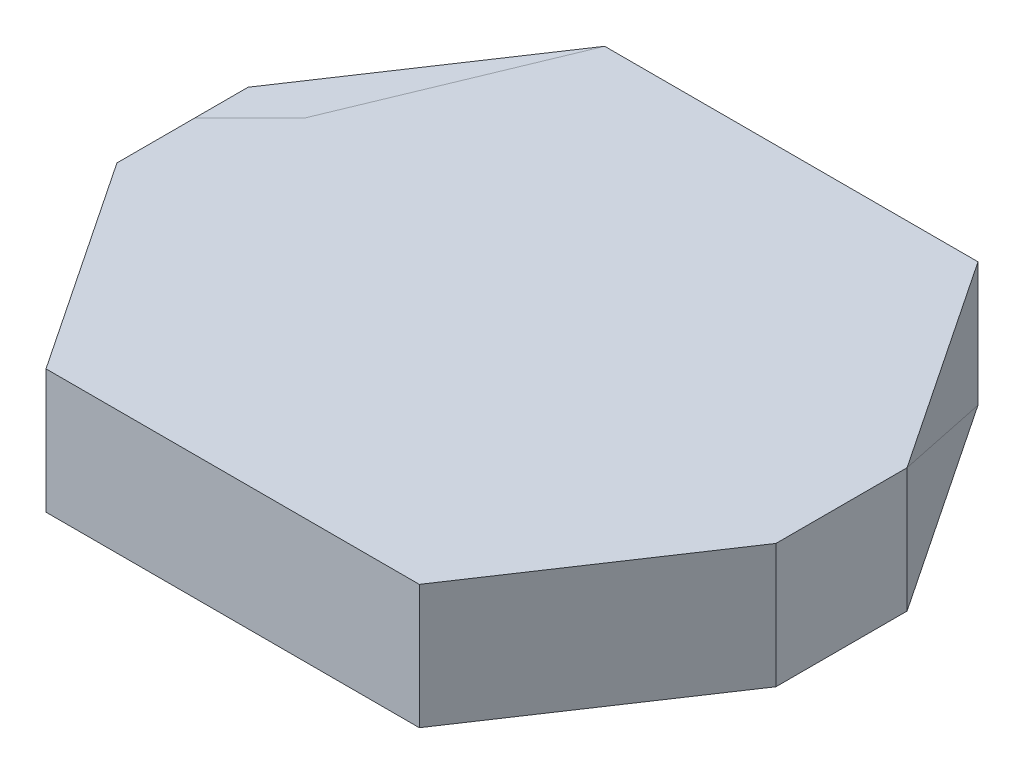
ISO-10303-21;
HEADER;
FILE_DESCRIPTION(('STEP AP214'),'2;1');
FILE_NAME('part.step','',(''),(''),'','','');
FILE_SCHEMA(('AUTOMOTIVE_DESIGN { 1 0 10303 214 1 1 1 1 }'));
ENDSEC;
DATA;
#1=APPLICATION_CONTEXT('core data for automotive mechanical design processes');
#2=APPLICATION_PROTOCOL_DEFINITION('international standard','automotive_design',2000,#1);
#3=PRODUCT_CONTEXT('',#1,'mechanical');
#4=PRODUCT('Part','Part','',(#3));
#5=PRODUCT_RELATED_PRODUCT_CATEGORY('part','',(#4));
#6=PRODUCT_DEFINITION_FORMATION('','',#4);
#7=PRODUCT_DEFINITION_CONTEXT('part definition',#1,'design');
#8=PRODUCT_DEFINITION('design','',#6,#7);
#9=PRODUCT_DEFINITION_SHAPE('','',#8);
#10=(LENGTH_UNIT() NAMED_UNIT(*) SI_UNIT(.MILLI.,.METRE.));
#11=(NAMED_UNIT(*) PLANE_ANGLE_UNIT() SI_UNIT($,.RADIAN.));
#12=(NAMED_UNIT(*) SI_UNIT($,.STERADIAN.) SOLID_ANGLE_UNIT());
#13=UNCERTAINTY_MEASURE_WITH_UNIT(LENGTH_MEASURE(1.E-05),#10,'distance_accuracy_value','');
#14=(GEOMETRIC_REPRESENTATION_CONTEXT(3) GLOBAL_UNCERTAINTY_ASSIGNED_CONTEXT((#13)) GLOBAL_UNIT_ASSIGNED_CONTEXT((#10,
#11,#12)) REPRESENTATION_CONTEXT('',''));
#15=CARTESIAN_POINT('',(0.,0.,0.));
#16=DIRECTION('',(0.,0.,1.));
#17=DIRECTION('',(1.,0.,0.));
#18=AXIS2_PLACEMENT_3D('',#15,#16,#17);
#19=CARTESIAN_POINT('',(26.5398584417511,10.,5.27910607256974));
#20=DIRECTION('',(-1.,0.,0.));
#21=DIRECTION('',(0.,0.,1.));
#22=AXIS2_PLACEMENT_3D('',#19,#20,#21);
#23=PLANE('',#22);
#24=DIRECTION('',(0.,0.,-1.));
#25=VECTOR('',#24,1.);
#26=CARTESIAN_POINT('',(26.5398584417511,0.,5.27910607256974));
#27=LINE('',#26,#25);
#28=CARTESIAN_POINT('',(26.5398584417511,0.,5.27910607256974));
#29=VERTEX_POINT('',#28);
#30=CARTESIAN_POINT('',(26.5398584417511,0.,-5.27910607256975));
#31=VERTEX_POINT('',#30);
#32=EDGE_CURVE('E147',#29,#31,#27,.T.);
#33=ORIENTED_EDGE('',*,*,#32,.T.);
#34=DIRECTION('',(0.,-1.,0.));
#35=VECTOR('',#34,1.);
#36=CARTESIAN_POINT('',(26.5398584417511,10.,-5.27910607256975));
#37=LINE('',#36,#35);
#38=CARTESIAN_POINT('',(26.5398584417511,10.,-5.27910607256975));
#39=VERTEX_POINT('',#38);
#40=EDGE_CURVE('E12',#39,#31,#37,.T.);
#41=ORIENTED_EDGE('',*,*,#40,.F.);
#42=DIRECTION('',(0.,0.,-1.));
#43=VECTOR('',#42,1.);
#44=CARTESIAN_POINT('',(26.5398584417511,10.,5.27910607256974));
#45=LINE('',#44,#43);
#46=CARTESIAN_POINT('',(26.5398584417511,10.,5.27910607256974));
#47=VERTEX_POINT('',#46);
#48=EDGE_CURVE('E161',#47,#39,#45,.T.);
#49=ORIENTED_EDGE('',*,*,#48,.F.);
#50=DIRECTION('',(0.,-1.,0.));
#51=VECTOR('',#50,1.);
#52=CARTESIAN_POINT('',(26.5398584417511,10.,5.27910607256974));
#53=LINE('',#52,#51);
#54=EDGE_CURVE('E143',#47,#29,#53,.T.);
#55=ORIENTED_EDGE('',*,*,#54,.T.);
#56=EDGE_LOOP('',(#33,#41,#49,#55));
#57=FACE_BOUND('',#56,.T.);
#58=ADVANCED_FACE('F51',(#57),#23,.F.);
#59=CARTESIAN_POINT('',(26.5398584417511,10.,-5.27910607256975));
#60=DIRECTION('',(-0.831469612302545,0.,0.555570233019603));
#61=DIRECTION('',(0.555570233019603,0.,0.831469612302545));
#62=AXIS2_PLACEMENT_3D('',#59,#60,#61);
#63=PLANE('',#62);
#64=DIRECTION('',(-0.555570233019603,0.,-0.831469612302545));
#65=VECTOR('',#64,1.);
#66=CARTESIAN_POINT('',(26.5398584417511,0.,-5.27910607256975));
#67=LINE('',#66,#65);
#68=CARTESIAN_POINT('',(15.0336221733761,0.,-22.4994055784104));
#69=VERTEX_POINT('',#68);
#70=EDGE_CURVE('E150',#31,#69,#67,.T.);
#71=ORIENTED_EDGE('',*,*,#70,.T.);
#72=DIRECTION('',(0.,-1.,0.));
#73=VECTOR('',#72,1.);
#74=CARTESIAN_POINT('',(15.0336221733761,10.,-22.4994055784104));
#75=LINE('',#74,#73);
#76=CARTESIAN_POINT('',(15.0336221733761,10.,-22.4994055784104));
#77=VERTEX_POINT('',#76);
#78=EDGE_CURVE('E59',#77,#69,#75,.T.);
#79=ORIENTED_EDGE('',*,*,#78,.F.);
#80=DIRECTION('',(-0.555570233019603,0.,-0.831469612302545));
#81=VECTOR('',#80,1.);
#82=CARTESIAN_POINT('',(26.5398584417511,10.,-5.27910607256975));
#83=LINE('',#82,#81);
#84=EDGE_CURVE('E110',#39,#77,#83,.T.);
#85=ORIENTED_EDGE('',*,*,#84,.F.);
#86=ORIENTED_EDGE('',*,*,#40,.T.);
#87=EDGE_LOOP('',(#71,#79,#85,#86));
#88=FACE_BOUND('',#87,.T.);
#89=ADVANCED_FACE('F196',(#88),#63,.F.);
#90=CARTESIAN_POINT('',(15.0336221733761,10.,-22.4994055784104));
#91=DIRECTION('',(0.,0.,1.));
#92=DIRECTION('',(1.,0.,0.));
#93=AXIS2_PLACEMENT_3D('',#90,#91,#92);
#94=PLANE('',#93);
#95=DIRECTION('',(-1.,0.,0.));
#96=VECTOR('',#95,1.);
#97=CARTESIAN_POINT('',(15.0336221733761,0.,-22.4994055784104));
#98=LINE('',#97,#96);
#99=CARTESIAN_POINT('',(-15.0336221733761,0.,-22.4994055784104));
#100=VERTEX_POINT('',#99);
#101=EDGE_CURVE('E152',#69,#100,#98,.T.);
#102=ORIENTED_EDGE('',*,*,#101,.T.);
#103=DIRECTION('',(0.,-1.,0.));
#104=VECTOR('',#103,1.);
#105=CARTESIAN_POINT('',(-15.0336221733761,10.,-22.4994055784104));
#106=LINE('',#105,#104);
#107=CARTESIAN_POINT('',(-15.0336221733761,10.,-22.4994055784104));
#108=VERTEX_POINT('',#107);
#109=EDGE_CURVE('E168',#108,#100,#106,.T.);
#110=ORIENTED_EDGE('',*,*,#109,.F.);
#111=DIRECTION('',(-1.,0.,0.));
#112=VECTOR('',#111,1.);
#113=CARTESIAN_POINT('',(15.0336221733761,10.,-22.4994055784104));
#114=LINE('',#113,#112);
#115=EDGE_CURVE('E176',#77,#108,#114,.T.);
#116=ORIENTED_EDGE('',*,*,#115,.F.);
#117=ORIENTED_EDGE('',*,*,#78,.T.);
#118=EDGE_LOOP('',(#102,#110,#116,#117));
#119=FACE_BOUND('',#118,.T.);
#120=ADVANCED_FACE('F174',(#119),#94,.F.);
#121=CARTESIAN_POINT('',(-15.0336221733761,10.,-22.4994055784104));
#122=DIRECTION('',(0.831469612302545,0.,0.555570233019603));
#123=DIRECTION('',(0.555570233019603,0.,-0.831469612302545));
#124=AXIS2_PLACEMENT_3D('',#121,#122,#123);
#125=PLANE('',#124);
#126=DIRECTION('',(-0.555570233019603,0.,0.831469612302545));
#127=VECTOR('',#126,1.);
#128=CARTESIAN_POINT('',(-15.0336221733761,0.,-22.4994055784104));
#129=LINE('',#128,#127);
#130=CARTESIAN_POINT('',(-26.5398584417511,0.,-5.27910607256975));
#131=VERTEX_POINT('',#130);
#132=EDGE_CURVE('E154',#100,#131,#129,.T.);
#133=ORIENTED_EDGE('',*,*,#132,.T.);
#134=DIRECTION('',(0.,-1.,0.));
#135=VECTOR('',#134,1.);
#136=CARTESIAN_POINT('',(-26.5398584417511,10.,-5.27910607256975));
#137=LINE('',#136,#135);
#138=CARTESIAN_POINT('',(-26.5398584417511,10.,-5.27910607256975));
#139=VERTEX_POINT('',#138);
#140=EDGE_CURVE('E165',#139,#131,#137,.T.);
#141=ORIENTED_EDGE('',*,*,#140,.F.);
#142=DIRECTION('',(-0.555570233019603,0.,0.831469612302545));
#143=VECTOR('',#142,1.);
#144=CARTESIAN_POINT('',(-15.0336221733761,10.,-22.4994055784104));
#145=LINE('',#144,#143);
#146=EDGE_CURVE('E188',#108,#139,#145,.T.);
#147=ORIENTED_EDGE('',*,*,#146,.F.);
#148=ORIENTED_EDGE('',*,*,#109,.T.);
#149=EDGE_LOOP('',(#133,#141,#147,#148));
#150=FACE_BOUND('',#149,.T.);
#151=ADVANCED_FACE('F184',(#150),#125,.F.);
#152=CARTESIAN_POINT('',(-26.5398584417511,10.,-5.27910607256975));
#153=DIRECTION('',(1.,0.,0.));
#154=DIRECTION('',(0.,0.,-1.));
#155=AXIS2_PLACEMENT_3D('',#152,#153,#154);
#156=PLANE('',#155);
#157=DIRECTION('',(0.,0.,1.));
#158=VECTOR('',#157,1.);
#159=CARTESIAN_POINT('',(-26.5398584417511,0.,-5.27910607256975));
#160=LINE('',#159,#158);
#161=CARTESIAN_POINT('',(-26.5398584417511,0.,5.27910607256974));
#162=VERTEX_POINT('',#161);
#163=EDGE_CURVE('E156',#131,#162,#160,.T.);
#164=ORIENTED_EDGE('',*,*,#163,.T.);
#165=DIRECTION('',(0.,-1.,0.));
#166=VECTOR('',#165,1.);
#167=CARTESIAN_POINT('',(-26.5398584417511,10.,5.27910607256974));
#168=LINE('',#167,#166);
#169=CARTESIAN_POINT('',(-26.5398584417511,10.,5.27910607256974));
#170=VERTEX_POINT('',#169);
#171=EDGE_CURVE('E138',#170,#162,#168,.T.);
#172=ORIENTED_EDGE('',*,*,#171,.F.);
#173=DIRECTION('',(0.,0.,1.));
#174=VECTOR('',#173,1.);
#175=CARTESIAN_POINT('',(-26.5398584417511,10.,-5.27910607256975));
#176=LINE('',#175,#174);
#177=EDGE_CURVE('E129',#139,#170,#176,.T.);
#178=ORIENTED_EDGE('',*,*,#177,.F.);
#179=ORIENTED_EDGE('',*,*,#140,.T.);
#180=EDGE_LOOP('',(#164,#172,#178,#179));
#181=FACE_BOUND('',#180,.T.);
#182=ADVANCED_FACE('F187',(#181),#156,.F.);
#183=CARTESIAN_POINT('',(-26.5398584417511,10.,5.27910607256974));
#184=DIRECTION('',(0.831469612302545,0.,-0.555570233019603));
#185=DIRECTION('',(-0.555570233019603,0.,-0.831469612302545));
#186=AXIS2_PLACEMENT_3D('',#183,#184,#185);
#187=PLANE('',#186);
#188=DIRECTION('',(0.555570233019603,0.,0.831469612302545));
#189=VECTOR('',#188,1.);
#190=CARTESIAN_POINT('',(-26.5398584417511,0.,5.27910607256974));
#191=LINE('',#190,#189);
#192=CARTESIAN_POINT('',(-15.0336221733761,0.,22.4994055784104));
#193=VERTEX_POINT('',#192);
#194=EDGE_CURVE('E137',#162,#193,#191,.T.);
#195=ORIENTED_EDGE('',*,*,#194,.T.);
#196=DIRECTION('',(0.,-1.,0.));
#197=VECTOR('',#196,1.);
#198=CARTESIAN_POINT('',(-15.0336221733761,10.,22.4994055784104));
#199=LINE('',#198,#197);
#200=CARTESIAN_POINT('',(-15.0336221733761,10.,22.4994055784104));
#201=VERTEX_POINT('',#200);
#202=EDGE_CURVE('E134',#201,#193,#199,.T.);
#203=ORIENTED_EDGE('',*,*,#202,.F.);
#204=DIRECTION('',(0.555570233019603,0.,0.831469612302545));
#205=VECTOR('',#204,1.);
#206=CARTESIAN_POINT('',(-26.5398584417511,10.,5.27910607256974));
#207=LINE('',#206,#205);
#208=EDGE_CURVE('E123',#170,#201,#207,.T.);
#209=ORIENTED_EDGE('',*,*,#208,.F.);
#210=ORIENTED_EDGE('',*,*,#171,.T.);
#211=EDGE_LOOP('',(#195,#203,#209,#210));
#212=FACE_BOUND('',#211,.T.);
#213=ADVANCED_FACE('F135',(#212),#187,.F.);
#214=CARTESIAN_POINT('',(-15.0336221733761,10.,22.4994055784104));
#215=DIRECTION('',(0.,0.,-1.));
#216=DIRECTION('',(-1.,0.,0.));
#217=AXIS2_PLACEMENT_3D('',#214,#215,#216);
#218=PLANE('',#217);
#219=DIRECTION('',(1.,0.,0.));
#220=VECTOR('',#219,1.);
#221=CARTESIAN_POINT('',(-15.0336221733761,0.,22.4994055784104));
#222=LINE('',#221,#220);
#223=CARTESIAN_POINT('',(15.0336221733761,0.,22.4994055784104));
#224=VERTEX_POINT('',#223);
#225=EDGE_CURVE('E96',#193,#224,#222,.T.);
#226=ORIENTED_EDGE('',*,*,#225,.T.);
#227=DIRECTION('',(0.,-1.,0.));
#228=VECTOR('',#227,1.);
#229=CARTESIAN_POINT('',(15.0336221733761,10.,22.4994055784104));
#230=LINE('',#229,#228);
#231=CARTESIAN_POINT('',(15.0336221733761,10.,22.4994055784104));
#232=VERTEX_POINT('',#231);
#233=EDGE_CURVE('E139',#232,#224,#230,.T.);
#234=ORIENTED_EDGE('',*,*,#233,.F.);
#235=DIRECTION('',(1.,0.,0.));
#236=VECTOR('',#235,1.);
#237=CARTESIAN_POINT('',(-15.0336221733761,10.,22.4994055784104));
#238=LINE('',#237,#236);
#239=EDGE_CURVE('E127',#201,#232,#238,.T.);
#240=ORIENTED_EDGE('',*,*,#239,.F.);
#241=ORIENTED_EDGE('',*,*,#202,.T.);
#242=EDGE_LOOP('',(#226,#234,#240,#241));
#243=FACE_BOUND('',#242,.T.);
#244=ADVANCED_FACE('F141',(#243),#218,.F.);
#245=CARTESIAN_POINT('',(15.0336221733761,10.,22.4994055784104));
#246=DIRECTION('',(-0.831469612302545,0.,-0.555570233019603));
#247=DIRECTION('',(-0.555570233019603,0.,0.831469612302545));
#248=AXIS2_PLACEMENT_3D('',#245,#246,#247);
#249=PLANE('',#248);
#250=DIRECTION('',(0.555570233019603,0.,-0.831469612302545));
#251=VECTOR('',#250,1.);
#252=CARTESIAN_POINT('',(15.0336221733761,0.,22.4994055784104));
#253=LINE('',#252,#251);
#254=EDGE_CURVE('E102',#224,#29,#253,.T.);
#255=ORIENTED_EDGE('',*,*,#254,.T.);
#256=ORIENTED_EDGE('',*,*,#54,.F.);
#257=DIRECTION('',(0.555570233019603,0.,-0.831469612302545));
#258=VECTOR('',#257,1.);
#259=CARTESIAN_POINT('',(15.0336221733761,10.,22.4994055784104));
#260=LINE('',#259,#258);
#261=EDGE_CURVE('E67',#232,#47,#260,.T.);
#262=ORIENTED_EDGE('',*,*,#261,.F.);
#263=ORIENTED_EDGE('',*,*,#233,.T.);
#264=EDGE_LOOP('',(#255,#256,#262,#263));
#265=FACE_BOUND('',#264,.T.);
#266=ADVANCED_FACE('F212',(#265),#249,.F.);
#267=CARTESIAN_POINT('',(0.,10.,0.));
#268=DIRECTION('',(0.,1.,0.));
#269=DIRECTION('',(0.,0.,1.));
#270=AXIS2_PLACEMENT_3D('',#267,#268,#269);
#271=PLANE('',#270);
#272=ORIENTED_EDGE('',*,*,#48,.T.);
#273=ORIENTED_EDGE('',*,*,#84,.T.);
#274=ORIENTED_EDGE('',*,*,#115,.T.);
#275=ORIENTED_EDGE('',*,*,#146,.T.);
#276=ORIENTED_EDGE('',*,*,#177,.T.);
#277=ORIENTED_EDGE('',*,*,#208,.T.);
#278=ORIENTED_EDGE('',*,*,#239,.T.);
#279=ORIENTED_EDGE('',*,*,#261,.T.);
#280=EDGE_LOOP('',(#272,#273,#274,#275,#276,#277,#278,#279));
#281=FACE_BOUND('',#280,.T.);
#282=ADVANCED_FACE('F125',(#281),#271,.T.);
#283=CARTESIAN_POINT('',(0.,0.,0.));
#284=DIRECTION('',(0.,1.,0.));
#285=DIRECTION('',(0.,0.,1.));
#286=AXIS2_PLACEMENT_3D('',#283,#284,#285);
#287=PLANE('',#286);
#288=ORIENTED_EDGE('',*,*,#32,.F.);
#289=ORIENTED_EDGE('',*,*,#254,.F.);
#290=ORIENTED_EDGE('',*,*,#225,.F.);
#291=ORIENTED_EDGE('',*,*,#194,.F.);
#292=ORIENTED_EDGE('',*,*,#163,.F.);
#293=ORIENTED_EDGE('',*,*,#132,.F.);
#294=ORIENTED_EDGE('',*,*,#101,.F.);
#295=ORIENTED_EDGE('',*,*,#70,.F.);
#296=EDGE_LOOP('',(#288,#289,#290,#291,#292,#293,#294,#295));
#297=FACE_BOUND('',#296,.T.);
#298=ADVANCED_FACE('F180',(#297),#287,.F.);
#299=CLOSED_SHELL('',(#58,#89,#120,#151,#182,#213,#244,#266,#282,#298));
#300=MANIFOLD_SOLID_BREP('B2',#299);
#301=CARTESIAN_POINT('',(26.5398584417511,10.,5.27910607256974));
#302=DIRECTION('',(-1.,0.,0.));
#303=DIRECTION('',(0.,0.,1.));
#304=AXIS2_PLACEMENT_3D('',#301,#302,#303);
#305=PLANE('',#304);
#306=DIRECTION('',(0.,0.,-1.));
#307=VECTOR('',#306,1.);
#308=CARTESIAN_POINT('',(26.5398584417511,0.,5.27910607256974));
#309=LINE('',#308,#307);
#310=CARTESIAN_POINT('',(26.5398584417511,0.,5.27910607256974));
#311=VERTEX_POINT('',#310);
#312=CARTESIAN_POINT('',(26.5398584417511,0.,-5.27910607256975));
#313=VERTEX_POINT('',#312);
#314=EDGE_CURVE('E375',#311,#313,#309,.T.);
#315=ORIENTED_EDGE('',*,*,#314,.T.);
#316=DIRECTION('',(0.,-1.,0.));
#317=VECTOR('',#316,1.);
#318=CARTESIAN_POINT('',(26.5398584417511,10.,-5.27910607256975));
#319=LINE('',#318,#317);
#320=CARTESIAN_POINT('',(26.5398584417511,10.,-5.27910607256975));
#321=VERTEX_POINT('',#320);
#322=EDGE_CURVE('E49',#321,#313,#319,.T.);
#323=ORIENTED_EDGE('',*,*,#322,.F.);
#324=DIRECTION('',(0.,0.,-1.));
#325=VECTOR('',#324,1.);
#326=CARTESIAN_POINT('',(26.5398584417511,10.,5.27910607256974));
#327=LINE('',#326,#325);
#328=CARTESIAN_POINT('',(26.5398584417511,10.,5.27910607256974));
#329=VERTEX_POINT('',#328);
#330=EDGE_CURVE('E389',#329,#321,#327,.T.);
#331=ORIENTED_EDGE('',*,*,#330,.F.);
#332=DIRECTION('',(0.,-1.,0.));
#333=VECTOR('',#332,1.);
#334=CARTESIAN_POINT('',(26.5398584417511,10.,5.27910607256974));
#335=LINE('',#334,#333);
#336=EDGE_CURVE('E371',#329,#311,#335,.T.);
#337=ORIENTED_EDGE('',*,*,#336,.T.);
#338=EDGE_LOOP('',(#315,#323,#331,#337));
#339=FACE_BOUND('',#338,.T.);
#340=ADVANCED_FACE('F279',(#339),#305,.F.);
#341=CARTESIAN_POINT('',(26.5398584417511,10.,-5.27910607256975));
#342=DIRECTION('',(-0.831469612302545,0.,0.555570233019603));
#343=DIRECTION('',(0.555570233019603,0.,0.831469612302545));
#344=AXIS2_PLACEMENT_3D('',#341,#342,#343);
#345=PLANE('',#344);
#346=DIRECTION('',(-0.555570233019603,0.,-0.831469612302545));
#347=VECTOR('',#346,1.);
#348=CARTESIAN_POINT('',(26.5398584417511,0.,-5.27910607256975));
#349=LINE('',#348,#347);
#350=CARTESIAN_POINT('',(15.0336221733761,0.,-22.4994055784104));
#351=VERTEX_POINT('',#350);
#352=EDGE_CURVE('E378',#313,#351,#349,.T.);
#353=ORIENTED_EDGE('',*,*,#352,.T.);
#354=DIRECTION('',(0.,-1.,0.));
#355=VECTOR('',#354,1.);
#356=CARTESIAN_POINT('',(15.0336221733761,10.,-22.4994055784104));
#357=LINE('',#356,#355);
#358=CARTESIAN_POINT('',(15.0336221733761,10.,-22.4994055784104));
#359=VERTEX_POINT('',#358);
#360=EDGE_CURVE('E287',#359,#351,#357,.T.);
#361=ORIENTED_EDGE('',*,*,#360,.F.);
#362=DIRECTION('',(-0.555570233019603,0.,-0.831469612302545));
#363=VECTOR('',#362,1.);
#364=CARTESIAN_POINT('',(26.5398584417511,10.,-5.27910607256975));
#365=LINE('',#364,#363);
#366=EDGE_CURVE('E338',#321,#359,#365,.T.);
#367=ORIENTED_EDGE('',*,*,#366,.F.);
#368=ORIENTED_EDGE('',*,*,#322,.T.);
#369=EDGE_LOOP('',(#353,#361,#367,#368));
#370=FACE_BOUND('',#369,.T.);
#371=ADVANCED_FACE('F424',(#370),#345,.F.);
#372=CARTESIAN_POINT('',(15.0336221733761,10.,-22.4994055784104));
#373=DIRECTION('',(0.,0.,1.));
#374=DIRECTION('',(1.,0.,0.));
#375=AXIS2_PLACEMENT_3D('',#372,#373,#374);
#376=PLANE('',#375);
#377=DIRECTION('',(-1.,0.,0.));
#378=VECTOR('',#377,1.);
#379=CARTESIAN_POINT('',(15.0336221733761,0.,-22.4994055784104));
#380=LINE('',#379,#378);
#381=CARTESIAN_POINT('',(-15.0336221733761,0.,-22.4994055784104));
#382=VERTEX_POINT('',#381);
#383=EDGE_CURVE('E380',#351,#382,#380,.T.);
#384=ORIENTED_EDGE('',*,*,#383,.T.);
#385=DIRECTION('',(0.,-1.,0.));
#386=VECTOR('',#385,1.);
#387=CARTESIAN_POINT('',(-15.0336221733761,10.,-22.4994055784104));
#388=LINE('',#387,#386);
#389=CARTESIAN_POINT('',(-15.0336221733761,10.,-22.4994055784104));
#390=VERTEX_POINT('',#389);
#391=EDGE_CURVE('E396',#390,#382,#388,.T.);
#392=ORIENTED_EDGE('',*,*,#391,.F.);
#393=DIRECTION('',(-1.,0.,0.));
#394=VECTOR('',#393,1.);
#395=CARTESIAN_POINT('',(15.0336221733761,10.,-22.4994055784104));
#396=LINE('',#395,#394);
#397=EDGE_CURVE('E404',#359,#390,#396,.T.);
#398=ORIENTED_EDGE('',*,*,#397,.F.);
#399=ORIENTED_EDGE('',*,*,#360,.T.);
#400=EDGE_LOOP('',(#384,#392,#398,#399));
#401=FACE_BOUND('',#400,.T.);
#402=ADVANCED_FACE('F402',(#401),#376,.F.);
#403=CARTESIAN_POINT('',(-15.0336221733761,10.,-22.4994055784104));
#404=DIRECTION('',(0.831469612302545,0.,0.555570233019603));
#405=DIRECTION('',(0.555570233019603,0.,-0.831469612302545));
#406=AXIS2_PLACEMENT_3D('',#403,#404,#405);
#407=PLANE('',#406);
#408=DIRECTION('',(-0.555570233019603,0.,0.831469612302545));
#409=VECTOR('',#408,1.);
#410=CARTESIAN_POINT('',(-15.0336221733761,0.,-22.4994055784104));
#411=LINE('',#410,#409);
#412=CARTESIAN_POINT('',(-26.5398584417511,0.,-5.27910607256975));
#413=VERTEX_POINT('',#412);
#414=EDGE_CURVE('E382',#382,#413,#411,.T.);
#415=ORIENTED_EDGE('',*,*,#414,.T.);
#416=DIRECTION('',(0.,-1.,0.));
#417=VECTOR('',#416,1.);
#418=CARTESIAN_POINT('',(-26.5398584417511,10.,-5.27910607256975));
#419=LINE('',#418,#417);
#420=CARTESIAN_POINT('',(-26.5398584417511,10.,-5.27910607256975));
#421=VERTEX_POINT('',#420);
#422=EDGE_CURVE('E393',#421,#413,#419,.T.);
#423=ORIENTED_EDGE('',*,*,#422,.F.);
#424=DIRECTION('',(-0.555570233019603,0.,0.831469612302545));
#425=VECTOR('',#424,1.);
#426=CARTESIAN_POINT('',(-15.0336221733761,10.,-22.4994055784104));
#427=LINE('',#426,#425);
#428=EDGE_CURVE('E416',#390,#421,#427,.T.);
#429=ORIENTED_EDGE('',*,*,#428,.F.);
#430=ORIENTED_EDGE('',*,*,#391,.T.);
#431=EDGE_LOOP('',(#415,#423,#429,#430));
#432=FACE_BOUND('',#431,.T.);
#433=ADVANCED_FACE('F412',(#432),#407,.F.);
#434=CARTESIAN_POINT('',(-26.5398584417511,10.,-5.27910607256975));
#435=DIRECTION('',(1.,0.,0.));
#436=DIRECTION('',(0.,0.,-1.));
#437=AXIS2_PLACEMENT_3D('',#434,#435,#436);
#438=PLANE('',#437);
#439=DIRECTION('',(0.,0.,1.));
#440=VECTOR('',#439,1.);
#441=CARTESIAN_POINT('',(-26.5398584417511,0.,-5.27910607256975));
#442=LINE('',#441,#440);
#443=CARTESIAN_POINT('',(-26.5398584417511,0.,5.27910607256974));
#444=VERTEX_POINT('',#443);
#445=EDGE_CURVE('E384',#413,#444,#442,.T.);
#446=ORIENTED_EDGE('',*,*,#445,.T.);
#447=DIRECTION('',(0.,-1.,0.));
#448=VECTOR('',#447,1.);
#449=CARTESIAN_POINT('',(-26.5398584417511,10.,5.27910607256974));
#450=LINE('',#449,#448);
#451=CARTESIAN_POINT('',(-26.5398584417511,10.,5.27910607256974));
#452=VERTEX_POINT('',#451);
#453=EDGE_CURVE('E366',#452,#444,#450,.T.);
#454=ORIENTED_EDGE('',*,*,#453,.F.);
#455=DIRECTION('',(0.,0.,1.));
#456=VECTOR('',#455,1.);
#457=CARTESIAN_POINT('',(-26.5398584417511,10.,-5.27910607256975));
#458=LINE('',#457,#456);
#459=EDGE_CURVE('E357',#421,#452,#458,.T.);
#460=ORIENTED_EDGE('',*,*,#459,.F.);
#461=ORIENTED_EDGE('',*,*,#422,.T.);
#462=EDGE_LOOP('',(#446,#454,#460,#461));
#463=FACE_BOUND('',#462,.T.);
#464=ADVANCED_FACE('F415',(#463),#438,.F.);
#465=CARTESIAN_POINT('',(-26.5398584417511,10.,5.27910607256974));
#466=DIRECTION('',(0.831469612302545,0.,-0.555570233019603));
#467=DIRECTION('',(-0.555570233019603,0.,-0.831469612302545));
#468=AXIS2_PLACEMENT_3D('',#465,#466,#467);
#469=PLANE('',#468);
#470=DIRECTION('',(0.555570233019603,0.,0.831469612302545));
#471=VECTOR('',#470,1.);
#472=CARTESIAN_POINT('',(-26.5398584417511,0.,5.27910607256974));
#473=LINE('',#472,#471);
#474=CARTESIAN_POINT('',(-15.0336221733761,0.,22.4994055784104));
#475=VERTEX_POINT('',#474);
#476=EDGE_CURVE('E365',#444,#475,#473,.T.);
#477=ORIENTED_EDGE('',*,*,#476,.T.);
#478=DIRECTION('',(0.,-1.,0.));
#479=VECTOR('',#478,1.);
#480=CARTESIAN_POINT('',(-15.0336221733761,10.,22.4994055784104));
#481=LINE('',#480,#479);
#482=CARTESIAN_POINT('',(-15.0336221733761,10.,22.4994055784104));
#483=VERTEX_POINT('',#482);
#484=EDGE_CURVE('E362',#483,#475,#481,.T.);
#485=ORIENTED_EDGE('',*,*,#484,.F.);
#486=DIRECTION('',(0.555570233019603,0.,0.831469612302545));
#487=VECTOR('',#486,1.);
#488=CARTESIAN_POINT('',(-26.5398584417511,10.,5.27910607256974));
#489=LINE('',#488,#487);
#490=EDGE_CURVE('E351',#452,#483,#489,.T.);
#491=ORIENTED_EDGE('',*,*,#490,.F.);
#492=ORIENTED_EDGE('',*,*,#453,.T.);
#493=EDGE_LOOP('',(#477,#485,#491,#492));
#494=FACE_BOUND('',#493,.T.);
#495=ADVANCED_FACE('F363',(#494),#469,.F.);
#496=CARTESIAN_POINT('',(-15.0336221733761,10.,22.4994055784104));
#497=DIRECTION('',(0.,0.,-1.));
#498=DIRECTION('',(-1.,0.,0.));
#499=AXIS2_PLACEMENT_3D('',#496,#497,#498);
#500=PLANE('',#499);
#501=DIRECTION('',(1.,0.,0.));
#502=VECTOR('',#501,1.);
#503=CARTESIAN_POINT('',(-15.0336221733761,0.,22.4994055784104));
#504=LINE('',#503,#502);
#505=CARTESIAN_POINT('',(15.0336221733761,0.,22.4994055784104));
#506=VERTEX_POINT('',#505);
#507=EDGE_CURVE('E324',#475,#506,#504,.T.);
#508=ORIENTED_EDGE('',*,*,#507,.T.);
#509=DIRECTION('',(0.,-1.,0.));
#510=VECTOR('',#509,1.);
#511=CARTESIAN_POINT('',(15.0336221733761,10.,22.4994055784104));
#512=LINE('',#511,#510);
#513=CARTESIAN_POINT('',(15.0336221733761,10.,22.4994055784104));
#514=VERTEX_POINT('',#513);
#515=EDGE_CURVE('E367',#514,#506,#512,.T.);
#516=ORIENTED_EDGE('',*,*,#515,.F.);
#517=DIRECTION('',(1.,0.,0.));
#518=VECTOR('',#517,1.);
#519=CARTESIAN_POINT('',(-15.0336221733761,10.,22.4994055784104));
#520=LINE('',#519,#518);
#521=EDGE_CURVE('E355',#483,#514,#520,.T.);
#522=ORIENTED_EDGE('',*,*,#521,.F.);
#523=ORIENTED_EDGE('',*,*,#484,.T.);
#524=EDGE_LOOP('',(#508,#516,#522,#523));
#525=FACE_BOUND('',#524,.T.);
#526=ADVANCED_FACE('F369',(#525),#500,.F.);
#527=CARTESIAN_POINT('',(15.0336221733761,10.,22.4994055784104));
#528=DIRECTION('',(-0.831469612302545,0.,-0.555570233019603));
#529=DIRECTION('',(-0.555570233019603,0.,0.831469612302545));
#530=AXIS2_PLACEMENT_3D('',#527,#528,#529);
#531=PLANE('',#530);
#532=DIRECTION('',(0.555570233019603,0.,-0.831469612302545));
#533=VECTOR('',#532,1.);
#534=CARTESIAN_POINT('',(15.0336221733761,0.,22.4994055784104));
#535=LINE('',#534,#533);
#536=EDGE_CURVE('E330',#506,#311,#535,.T.);
#537=ORIENTED_EDGE('',*,*,#536,.T.);
#538=ORIENTED_EDGE('',*,*,#336,.F.);
#539=DIRECTION('',(0.555570233019603,0.,-0.831469612302545));
#540=VECTOR('',#539,1.);
#541=CARTESIAN_POINT('',(15.0336221733761,10.,22.4994055784104));
#542=LINE('',#541,#540);
#543=EDGE_CURVE('E295',#514,#329,#542,.T.);
#544=ORIENTED_EDGE('',*,*,#543,.F.);
#545=ORIENTED_EDGE('',*,*,#515,.T.);
#546=EDGE_LOOP('',(#537,#538,#544,#545));
#547=FACE_BOUND('',#546,.T.);
#548=ADVANCED_FACE('F440',(#547),#531,.F.);
#549=CARTESIAN_POINT('',(0.,10.,0.));
#550=DIRECTION('',(0.,1.,0.));
#551=DIRECTION('',(0.,0.,1.));
#552=AXIS2_PLACEMENT_3D('',#549,#550,#551);
#553=PLANE('',#552);
#554=ORIENTED_EDGE('',*,*,#330,.T.);
#555=ORIENTED_EDGE('',*,*,#366,.T.);
#556=ORIENTED_EDGE('',*,*,#397,.T.);
#557=ORIENTED_EDGE('',*,*,#428,.T.);
#558=ORIENTED_EDGE('',*,*,#459,.T.);
#559=ORIENTED_EDGE('',*,*,#490,.T.);
#560=ORIENTED_EDGE('',*,*,#521,.T.);
#561=ORIENTED_EDGE('',*,*,#543,.T.);
#562=EDGE_LOOP('',(#554,#555,#556,#557,#558,#559,#560,#561));
#563=FACE_BOUND('',#562,.T.);
#564=ADVANCED_FACE('F353',(#563),#553,.T.);
#565=CARTESIAN_POINT('',(0.,0.,0.));
#566=DIRECTION('',(0.,1.,0.));
#567=DIRECTION('',(0.,0.,1.));
#568=AXIS2_PLACEMENT_3D('',#565,#566,#567);
#569=PLANE('',#568);
#570=ORIENTED_EDGE('',*,*,#314,.F.);
#571=ORIENTED_EDGE('',*,*,#536,.F.);
#572=ORIENTED_EDGE('',*,*,#507,.F.);
#573=ORIENTED_EDGE('',*,*,#476,.F.);
#574=ORIENTED_EDGE('',*,*,#445,.F.);
#575=ORIENTED_EDGE('',*,*,#414,.F.);
#576=ORIENTED_EDGE('',*,*,#383,.F.);
#577=ORIENTED_EDGE('',*,*,#352,.F.);
#578=EDGE_LOOP('',(#570,#571,#572,#573,#574,#575,#576,#577));
#579=FACE_BOUND('',#578,.T.);
#580=ADVANCED_FACE('F408',(#579),#569,.F.);
#581=CLOSED_SHELL('',(#340,#371,#402,#433,#464,#495,#526,#548,#564,#580));
#582=MANIFOLD_SOLID_BREP('B6',#581);
#583=ADVANCED_BREP_SHAPE_REPRESENTATION('',(#18,#300,#582),#14);
#584=SHAPE_DEFINITION_REPRESENTATION(#9,#583);
ENDSEC;
END-ISO-10303-21;
